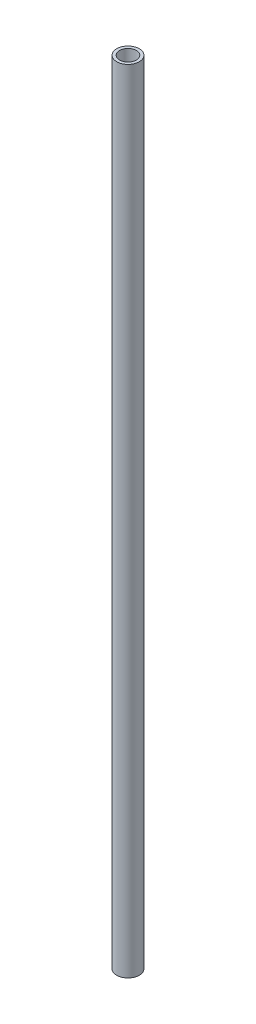
ISO-10303-21;
HEADER;
FILE_DESCRIPTION(('STEP AP214'),'2;1');
FILE_NAME('part.step','',(''),(''),'','','');
FILE_SCHEMA(('AUTOMOTIVE_DESIGN { 1 0 10303 214 1 1 1 1 }'));
ENDSEC;
DATA;
#1=APPLICATION_CONTEXT('core data for automotive mechanical design processes');
#2=APPLICATION_PROTOCOL_DEFINITION('international standard','automotive_design',2000,#1);
#3=PRODUCT_CONTEXT('',#1,'mechanical');
#4=PRODUCT('Part','Part','',(#3));
#5=PRODUCT_RELATED_PRODUCT_CATEGORY('part','',(#4));
#6=PRODUCT_DEFINITION_FORMATION('','',#4);
#7=PRODUCT_DEFINITION_CONTEXT('part definition',#1,'design');
#8=PRODUCT_DEFINITION('design','',#6,#7);
#9=PRODUCT_DEFINITION_SHAPE('','',#8);
#10=(LENGTH_UNIT() NAMED_UNIT(*) SI_UNIT(.MILLI.,.METRE.));
#11=(NAMED_UNIT(*) PLANE_ANGLE_UNIT() SI_UNIT($,.RADIAN.));
#12=(NAMED_UNIT(*) SI_UNIT($,.STERADIAN.) SOLID_ANGLE_UNIT());
#13=UNCERTAINTY_MEASURE_WITH_UNIT(LENGTH_MEASURE(1.E-05),#10,'distance_accuracy_value','');
#14=(GEOMETRIC_REPRESENTATION_CONTEXT(3) GLOBAL_UNCERTAINTY_ASSIGNED_CONTEXT((#13)) GLOBAL_UNIT_ASSIGNED_CONTEXT((#10,
#11,#12)) REPRESENTATION_CONTEXT('',''));
#15=CARTESIAN_POINT('',(0.,0.,0.));
#16=DIRECTION('',(0.,0.,1.));
#17=DIRECTION('',(1.,0.,0.));
#18=AXIS2_PLACEMENT_3D('',#15,#16,#17);
#19=CARTESIAN_POINT('',(0.,748.,0.));
#20=DIRECTION('',(0.,1.,0.));
#21=DIRECTION('',(0.,0.,1.));
#22=AXIS2_PLACEMENT_3D('',#19,#20,#21);
#23=PLANE('',#22);
#24=CARTESIAN_POINT('',(0.,748.,0.));
#25=DIRECTION('',(0.,1.,0.));
#26=DIRECTION('',(0.,0.,1.));
#27=AXIS2_PLACEMENT_3D('',#24,#25,#26);
#28=CIRCLE('',#27,10.668);
#29=CARTESIAN_POINT('',(0.,748.,10.668));
#30=VERTEX_POINT('',#29);
#31=EDGE_CURVE('E10',#30,#30,#28,.T.);
#32=ORIENTED_EDGE('',*,*,#31,.T.);
#33=EDGE_LOOP('',(#32));
#34=FACE_BOUND('',#33,.T.);
#35=CARTESIAN_POINT('',(0.,748.,0.));
#36=DIRECTION('',(0.,1.,0.));
#37=DIRECTION('',(0.,0.,1.));
#38=AXIS2_PLACEMENT_3D('',#35,#36,#37);
#39=CIRCLE('',#38,7.8994);
#40=CARTESIAN_POINT('',(0.,748.,7.8994));
#41=VERTEX_POINT('',#40);
#42=EDGE_CURVE('E44',#41,#41,#39,.T.);
#43=ORIENTED_EDGE('',*,*,#42,.F.);
#44=EDGE_LOOP('',(#43));
#45=FACE_BOUND('',#44,.T.);
#46=ADVANCED_FACE('F33',(#34,#45),#23,.T.);
#47=CARTESIAN_POINT('',(0.,0.,0.));
#48=DIRECTION('',(0.,1.,0.));
#49=DIRECTION('',(0.,0.,1.));
#50=AXIS2_PLACEMENT_3D('',#47,#48,#49);
#51=PLANE('',#50);
#52=CARTESIAN_POINT('',(0.,0.,0.));
#53=DIRECTION('',(0.,1.,0.));
#54=DIRECTION('',(0.,0.,1.));
#55=AXIS2_PLACEMENT_3D('',#52,#53,#54);
#56=CIRCLE('',#55,10.668);
#57=CARTESIAN_POINT('',(0.,0.,10.668));
#58=VERTEX_POINT('',#57);
#59=EDGE_CURVE('E37',#58,#58,#56,.T.);
#60=ORIENTED_EDGE('',*,*,#59,.F.);
#61=EDGE_LOOP('',(#60));
#62=FACE_BOUND('',#61,.T.);
#63=CARTESIAN_POINT('',(0.,0.,0.));
#64=DIRECTION('',(0.,1.,0.));
#65=DIRECTION('',(0.,0.,1.));
#66=AXIS2_PLACEMENT_3D('',#63,#64,#65);
#67=CIRCLE('',#66,7.8994);
#68=CARTESIAN_POINT('',(0.,0.,7.8994));
#69=VERTEX_POINT('',#68);
#70=EDGE_CURVE('E46',#69,#69,#67,.T.);
#71=ORIENTED_EDGE('',*,*,#70,.T.);
#72=EDGE_LOOP('',(#71));
#73=FACE_BOUND('',#72,.T.);
#74=ADVANCED_FACE('F56',(#62,#73),#51,.F.);
#75=CARTESIAN_POINT('',(0.,748.,0.));
#76=DIRECTION('',(0.,-1.,0.));
#77=DIRECTION('',(0.,0.,-1.));
#78=AXIS2_PLACEMENT_3D('',#75,#76,#77);
#79=CYLINDRICAL_SURFACE('',#78,10.668);
#80=ORIENTED_EDGE('',*,*,#31,.F.);
#81=EDGE_LOOP('',(#80));
#82=FACE_BOUND('',#81,.T.);
#83=ORIENTED_EDGE('',*,*,#59,.T.);
#84=EDGE_LOOP('',(#83));
#85=FACE_BOUND('',#84,.T.);
#86=ADVANCED_FACE('F35',(#82,#85),#79,.T.);
#87=CARTESIAN_POINT('',(0.,748.,0.));
#88=DIRECTION('',(0.,-1.,0.));
#89=DIRECTION('',(0.,0.,-1.));
#90=AXIS2_PLACEMENT_3D('',#87,#88,#89);
#91=CYLINDRICAL_SURFACE('',#90,7.8994);
#92=ORIENTED_EDGE('',*,*,#42,.T.);
#93=EDGE_LOOP('',(#92));
#94=FACE_BOUND('',#93,.T.);
#95=ORIENTED_EDGE('',*,*,#70,.F.);
#96=EDGE_LOOP('',(#95));
#97=FACE_BOUND('',#96,.T.);
#98=ADVANCED_FACE('F52',(#94,#97),#91,.F.);
#99=CLOSED_SHELL('',(#46,#74,#86,#98));
#100=MANIFOLD_SOLID_BREP('B2',#99);
#101=ADVANCED_BREP_SHAPE_REPRESENTATION('',(#18,#100),#14);
#102=SHAPE_DEFINITION_REPRESENTATION(#9,#101);
ENDSEC;
END-ISO-10303-21;
